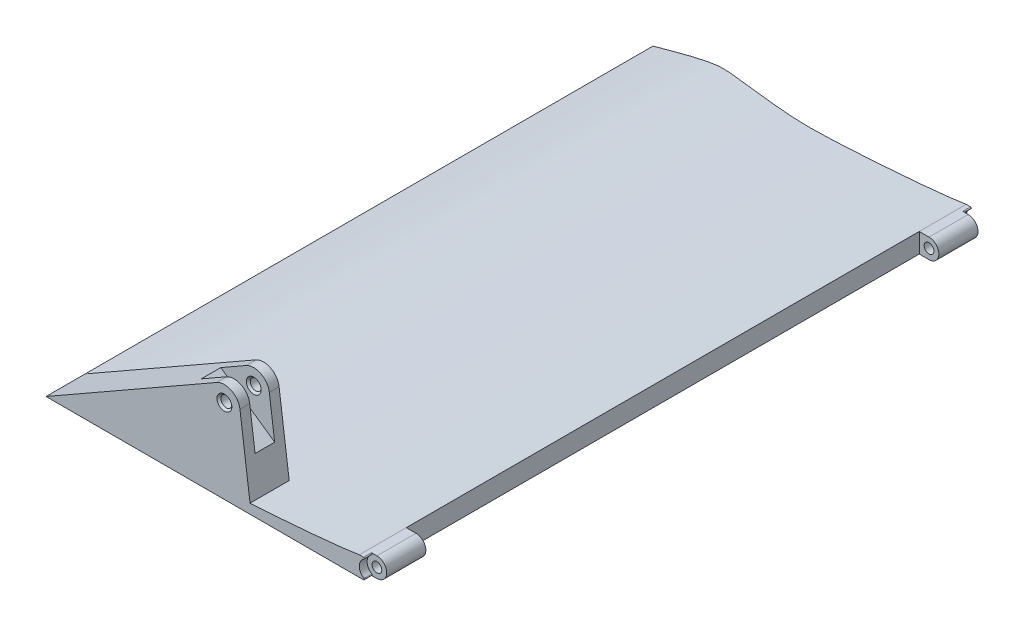
ISO-10303-21;
HEADER;
FILE_DESCRIPTION(('STEP AP214'),'2;1');
FILE_NAME('part.step','',(''),(''),'','','');
FILE_SCHEMA(('AUTOMOTIVE_DESIGN { 1 0 10303 214 1 1 1 1 }'));
ENDSEC;
DATA;
#1=APPLICATION_CONTEXT('core data for automotive mechanical design processes');
#2=APPLICATION_PROTOCOL_DEFINITION('international standard','automotive_design',2000,#1);
#3=PRODUCT_CONTEXT('',#1,'mechanical');
#4=PRODUCT('Part','Part','',(#3));
#5=PRODUCT_RELATED_PRODUCT_CATEGORY('part','',(#4));
#6=PRODUCT_DEFINITION_FORMATION('','',#4);
#7=PRODUCT_DEFINITION_CONTEXT('part definition',#1,'design');
#8=PRODUCT_DEFINITION('design','',#6,#7);
#9=PRODUCT_DEFINITION_SHAPE('','',#8);
#10=(LENGTH_UNIT() NAMED_UNIT(*) SI_UNIT(.MILLI.,.METRE.));
#11=(NAMED_UNIT(*) PLANE_ANGLE_UNIT() SI_UNIT($,.RADIAN.));
#12=(NAMED_UNIT(*) SI_UNIT($,.STERADIAN.) SOLID_ANGLE_UNIT());
#13=UNCERTAINTY_MEASURE_WITH_UNIT(LENGTH_MEASURE(1.E-05),#10,'distance_accuracy_value','');
#14=(GEOMETRIC_REPRESENTATION_CONTEXT(3) GLOBAL_UNCERTAINTY_ASSIGNED_CONTEXT((#13)) GLOBAL_UNIT_ASSIGNED_CONTEXT((#10,
#11,#12)) REPRESENTATION_CONTEXT('',''));
#15=CARTESIAN_POINT('',(0.,0.,0.));
#16=DIRECTION('',(0.,0.,1.));
#17=DIRECTION('',(1.,0.,0.));
#18=AXIS2_PLACEMENT_3D('',#15,#16,#17);
#19=CARTESIAN_POINT('',(5.55823766597802,21.4177270736507,67.5));
#20=DIRECTION('',(0.,0.,1.));
#21=DIRECTION('',(1.,0.,0.));
#22=AXIS2_PLACEMENT_3D('',#19,#20,#21);
#23=CYLINDRICAL_SURFACE('',#22,4.);
#24=CARTESIAN_POINT('',(5.55823766597802,21.4177270736507,70.));
#25=DIRECTION('',(0.,0.,-1.));
#26=DIRECTION('',(-1.,0.,0.));
#27=AXIS2_PLACEMENT_3D('',#24,#25,#26);
#28=CIRCLE('',#27,4.);
#29=CARTESIAN_POINT('',(9.52364594723854,21.9426434126139,70.));
#30=VERTEX_POINT('',#29);
#31=CARTESIAN_POINT('',(3.57419552363771,24.8909930838229,70.));
#32=VERTEX_POINT('',#31);
#33=EDGE_CURVE('E228',#30,#32,#28,.F.);
#34=ORIENTED_EDGE('',*,*,#33,.F.);
#35=DIRECTION('',(0.,0.,1.));
#36=VECTOR('',#35,1.);
#37=CARTESIAN_POINT('',(9.52364594723854,21.9426434126139,67.5));
#38=LINE('',#37,#36);
#39=CARTESIAN_POINT('',(9.52364594723854,21.9426434126139,67.5));
#40=VERTEX_POINT('',#39);
#41=EDGE_CURVE('E227',#40,#30,#38,.T.);
#42=ORIENTED_EDGE('',*,*,#41,.F.);
#43=CARTESIAN_POINT('',(5.55823766597802,21.4177270736507,67.5));
#44=DIRECTION('',(0.,0.,1.));
#45=DIRECTION('',(-1.,0.,0.));
#46=AXIS2_PLACEMENT_3D('',#43,#44,#45);
#47=CIRCLE('',#46,4.);
#48=CARTESIAN_POINT('',(3.57419552363771,24.8909930838229,67.5));
#49=VERTEX_POINT('',#48);
#50=EDGE_CURVE('E242',#40,#49,#47,.T.);
#51=ORIENTED_EDGE('',*,*,#50,.T.);
#52=DIRECTION('',(0.,0.,1.));
#53=VECTOR('',#52,1.);
#54=CARTESIAN_POINT('',(3.57419552363771,24.8909930838229,67.5));
#55=LINE('',#54,#53);
#56=EDGE_CURVE('E254',#49,#32,#55,.T.);
#57=ORIENTED_EDGE('',*,*,#56,.T.);
#58=EDGE_LOOP('',(#34,#42,#51,#57));
#59=FACE_BOUND('',#58,.T.);
#60=ADVANCED_FACE('F45',(#59),#23,.T.);
#61=CARTESIAN_POINT('',(5.55823766597802,21.4177270736507,67.5));
#62=DIRECTION('',(0.,0.,1.));
#63=DIRECTION('',(1.,0.,0.));
#64=AXIS2_PLACEMENT_3D('',#61,#62,#63);
#65=CYLINDRICAL_SURFACE('',#64,1.4);
#66=CARTESIAN_POINT('',(5.55823766597802,21.4177270736507,69.4999999999999));
#67=DIRECTION('',(0.,0.,-1.));
#68=DIRECTION('',(-1.,0.,0.));
#69=AXIS2_PLACEMENT_3D('',#66,#67,#68);
#70=CIRCLE('',#69,1.4);
#71=CARTESIAN_POINT('',(4.15823766597802,21.4177270736507,69.4999999999999));
#72=VERTEX_POINT('',#71);
#73=EDGE_CURVE('E285',#72,#72,#70,.F.);
#74=ORIENTED_EDGE('',*,*,#73,.T.);
#75=EDGE_LOOP('',(#74));
#76=FACE_BOUND('',#75,.T.);
#77=CARTESIAN_POINT('',(5.55823766597802,21.4177270736507,67.5));
#78=DIRECTION('',(0.,0.,1.));
#79=DIRECTION('',(1.,0.,0.));
#80=AXIS2_PLACEMENT_3D('',#77,#78,#79);
#81=CIRCLE('',#80,1.4);
#82=CARTESIAN_POINT('',(6.95823766597802,21.4177270736507,67.5));
#83=VERTEX_POINT('',#82);
#84=EDGE_CURVE('E236',#83,#83,#81,.T.);
#85=ORIENTED_EDGE('',*,*,#84,.F.);
#86=EDGE_LOOP('',(#85));
#87=FACE_BOUND('',#86,.T.);
#88=ADVANCED_FACE('F426',(#76,#87),#65,.F.);
#89=CARTESIAN_POINT('',(42.5,2.50000000000001,77.5));
#90=DIRECTION('',(0.,0.,-1.));
#91=DIRECTION('',(-1.,0.,0.));
#92=AXIS2_PLACEMENT_3D('',#89,#90,#91);
#93=CYLINDRICAL_SURFACE('',#92,2.50000000000001);
#94=DIRECTION('',(0.,0.,-1.));
#95=VECTOR('',#94,1.);
#96=CARTESIAN_POINT('',(42.5,0.,77.5));
#97=LINE('',#96,#95);
#98=CARTESIAN_POINT('',(42.5,0.,75.5));
#99=VERTEX_POINT('',#98);
#100=CARTESIAN_POINT('',(42.5,0.,65.5));
#101=VERTEX_POINT('',#100);
#102=EDGE_CURVE('E282',#99,#101,#97,.T.);
#103=ORIENTED_EDGE('',*,*,#102,.T.);
#104=CARTESIAN_POINT('',(42.5,2.50000000000001,65.5));
#105=DIRECTION('',(0.,0.,1.));
#106=DIRECTION('',(1.,0.,0.));
#107=AXIS2_PLACEMENT_3D('',#104,#105,#106);
#108=CIRCLE('',#107,2.50000000000001);
#109=CARTESIAN_POINT('',(42.5,5.00000000000002,65.5));
#110=VERTEX_POINT('',#109);
#111=EDGE_CURVE('E531',#101,#110,#108,.T.);
#112=ORIENTED_EDGE('',*,*,#111,.T.);
#113=DIRECTION('',(0.,0.,-1.));
#114=VECTOR('',#113,1.);
#115=CARTESIAN_POINT('',(42.5,5.00000000000002,77.5));
#116=LINE('',#115,#114);
#117=CARTESIAN_POINT('',(42.5,5.00000000000002,75.5));
#118=VERTEX_POINT('',#117);
#119=EDGE_CURVE('E480',#118,#110,#116,.T.);
#120=ORIENTED_EDGE('',*,*,#119,.F.);
#121=CARTESIAN_POINT('',(42.5,2.50000000000001,75.5));
#122=DIRECTION('',(0.,0.,1.));
#123=DIRECTION('',(1.,0.,0.));
#124=AXIS2_PLACEMENT_3D('',#121,#122,#123);
#125=CIRCLE('',#124,2.50000000000531);
#126=EDGE_CURVE('E356',#99,#118,#125,.T.);
#127=ORIENTED_EDGE('',*,*,#126,.F.);
#128=EDGE_LOOP('',(#103,#112,#120,#127));
#129=FACE_BOUND('',#128,.T.);
#130=ADVANCED_FACE('F398',(#129),#93,.T.);
#131=CARTESIAN_POINT('',(42.5,2.50000000000001,77.5));
#132=DIRECTION('',(0.,0.,-1.));
#133=DIRECTION('',(-1.,0.,0.));
#134=AXIS2_PLACEMENT_3D('',#131,#132,#133);
#135=CYLINDRICAL_SURFACE('',#134,1.25);
#136=CARTESIAN_POINT('',(42.5,2.50000000000001,65.5));
#137=DIRECTION('',(0.,0.,1.));
#138=DIRECTION('',(1.,0.,0.));
#139=AXIS2_PLACEMENT_3D('',#136,#137,#138);
#140=CIRCLE('',#139,1.25);
#141=CARTESIAN_POINT('',(43.75,2.50000000000001,65.5));
#142=VERTEX_POINT('',#141);
#143=EDGE_CURVE('E515',#142,#142,#140,.T.);
#144=ORIENTED_EDGE('',*,*,#143,.F.);
#145=EDGE_LOOP('',(#144));
#146=FACE_BOUND('',#145,.T.);
#147=CARTESIAN_POINT('',(42.5,2.50000000000001,75.5));
#148=DIRECTION('',(0.,0.,1.));
#149=DIRECTION('',(1.,0.,0.));
#150=AXIS2_PLACEMENT_3D('',#147,#148,#149);
#151=CIRCLE('',#150,1.25);
#152=CARTESIAN_POINT('',(43.75,2.50000000000001,75.5));
#153=VERTEX_POINT('',#152);
#154=EDGE_CURVE('E483',#153,#153,#151,.T.);
#155=ORIENTED_EDGE('',*,*,#154,.T.);
#156=EDGE_LOOP('',(#155));
#157=FACE_BOUND('',#156,.T.);
#158=ADVANCED_FACE('F597',(#146,#157),#135,.F.);
#159=CARTESIAN_POINT('',(40.,5.00000000000002,77.5));
#160=DIRECTION('',(0.,-1.,0.));
#161=DIRECTION('',(0.,0.,-1.));
#162=AXIS2_PLACEMENT_3D('',#159,#160,#161);
#163=PLANE('',#162);
#164=DIRECTION('',(-1.,0.,0.));
#165=VECTOR('',#164,1.);
#166=CARTESIAN_POINT('',(40.,5.00000000000002,77.5));
#167=LINE('',#166,#165);
#168=CARTESIAN_POINT('',(41.0857864376168,5.00000000000002,77.5));
#169=VERTEX_POINT('',#168);
#170=CARTESIAN_POINT('',(40.,5.00000000000002,77.5));
#171=VERTEX_POINT('',#170);
#172=EDGE_CURVE('E365',#169,#171,#167,.T.);
#173=ORIENTED_EDGE('',*,*,#172,.F.);
#174=DIRECTION('',(0.,0.,1.));
#175=VECTOR('',#174,1.);
#176=CARTESIAN_POINT('',(41.0857864376168,5.00000000000002,77.5));
#177=LINE('',#176,#175);
#178=CARTESIAN_POINT('',(41.0857864376168,5.00000000000002,75.5));
#179=VERTEX_POINT('',#178);
#180=EDGE_CURVE('E323',#169,#179,#177,.F.);
#181=ORIENTED_EDGE('',*,*,#180,.T.);
#182=DIRECTION('',(1.,0.,0.));
#183=VECTOR('',#182,1.);
#184=CARTESIAN_POINT('',(42.5,5.00000000000002,75.5));
#185=LINE('',#184,#183);
#186=EDGE_CURVE('E321',#179,#118,#185,.T.);
#187=ORIENTED_EDGE('',*,*,#186,.T.);
#188=ORIENTED_EDGE('',*,*,#119,.T.);
#189=DIRECTION('',(-1.,0.,0.));
#190=VECTOR('',#189,1.);
#191=CARTESIAN_POINT('',(42.5,5.00000000000002,65.5));
#192=LINE('',#191,#190);
#193=CARTESIAN_POINT('',(40.,5.00000000000002,65.5));
#194=VERTEX_POINT('',#193);
#195=EDGE_CURVE('E538',#110,#194,#192,.T.);
#196=ORIENTED_EDGE('',*,*,#195,.T.);
#197=DIRECTION('',(0.,0.,-1.));
#198=VECTOR('',#197,1.);
#199=CARTESIAN_POINT('',(40.,5.00000000000002,77.5));
#200=LINE('',#199,#198);
#201=EDGE_CURVE('E468',#171,#194,#200,.T.);
#202=ORIENTED_EDGE('',*,*,#201,.F.);
#203=EDGE_LOOP('',(#173,#181,#187,#188,#196,#202));
#204=FACE_BOUND('',#203,.T.);
#205=ADVANCED_FACE('F392',(#204),#163,.F.);
#206=CARTESIAN_POINT('',(42.5,5.00000000000002,-65.5));
#207=VERTEX_POINT('',#206);
#208=CARTESIAN_POINT('',(42.5,5.00000000000002,-75.5));
#209=VERTEX_POINT('',#208);
#210=EDGE_CURVE('E478',#207,#209,#116,.T.);
#211=ORIENTED_EDGE('',*,*,#210,.F.);
#212=CARTESIAN_POINT('',(42.5,2.50000000000001,-65.5));
#213=DIRECTION('',(0.,0.,-1.));
#214=DIRECTION('',(-1.,0.,0.));
#215=AXIS2_PLACEMENT_3D('',#212,#213,#214);
#216=CIRCLE('',#215,2.50000000000001);
#217=CARTESIAN_POINT('',(42.5,0.,-65.5));
#218=VERTEX_POINT('',#217);
#219=EDGE_CURVE('E545',#218,#207,#216,.F.);
#220=ORIENTED_EDGE('',*,*,#219,.F.);
#221=CARTESIAN_POINT('',(42.5,0.,-75.5));
#222=VERTEX_POINT('',#221);
#223=EDGE_CURVE('E481',#218,#222,#97,.T.);
#224=ORIENTED_EDGE('',*,*,#223,.T.);
#225=CARTESIAN_POINT('',(42.5,2.50000000000001,-75.5));
#226=DIRECTION('',(0.,0.,1.));
#227=DIRECTION('',(1.,0.,0.));
#228=AXIS2_PLACEMENT_3D('',#225,#226,#227);
#229=CIRCLE('',#228,2.50000000000531);
#230=EDGE_CURVE('E509',#222,#209,#229,.T.);
#231=ORIENTED_EDGE('',*,*,#230,.T.);
#232=EDGE_LOOP('',(#211,#220,#224,#231));
#233=FACE_BOUND('',#232,.T.);
#234=ADVANCED_FACE('F393',(#233),#93,.T.);
#235=CARTESIAN_POINT('',(42.5,2.50000000000001,-65.5));
#236=DIRECTION('',(0.,0.,-1.));
#237=DIRECTION('',(-1.,0.,0.));
#238=AXIS2_PLACEMENT_3D('',#235,#236,#237);
#239=CIRCLE('',#238,1.25);
#240=CARTESIAN_POINT('',(41.25,2.50000000000001,-65.5));
#241=VERTEX_POINT('',#240);
#242=EDGE_CURVE('E518',#241,#241,#239,.T.);
#243=ORIENTED_EDGE('',*,*,#242,.F.);
#244=EDGE_LOOP('',(#243));
#245=FACE_BOUND('',#244,.T.);
#246=CARTESIAN_POINT('',(42.5,2.50000000000001,-75.5));
#247=DIRECTION('',(0.,0.,-1.));
#248=DIRECTION('',(-1.,0.,0.));
#249=AXIS2_PLACEMENT_3D('',#246,#247,#248);
#250=CIRCLE('',#249,1.25);
#251=CARTESIAN_POINT('',(41.25,2.50000000000001,-75.5));
#252=VERTEX_POINT('',#251);
#253=EDGE_CURVE('E357',#252,#252,#250,.T.);
#254=ORIENTED_EDGE('',*,*,#253,.T.);
#255=EDGE_LOOP('',(#254));
#256=FACE_BOUND('',#255,.T.);
#257=ADVANCED_FACE('F396',(#245,#256),#135,.F.);
#258=CARTESIAN_POINT('',(42.5,2.50000000000001,77.5));
#259=DIRECTION('',(0.,0.,-1.));
#260=DIRECTION('',(-1.,0.,0.));
#261=AXIS2_PLACEMENT_3D('',#258,#259,#260);
#262=PLANE('',#261);
#263=CARTESIAN_POINT('',(5.55823766597802,21.4177270736507,77.5));
#264=DIRECTION('',(0.,0.,-1.));
#265=DIRECTION('',(-1.,0.,0.));
#266=AXIS2_PLACEMENT_3D('',#263,#264,#265);
#267=CIRCLE('',#266,1.90000000000007);
#268=CARTESIAN_POINT('',(3.65823766597795,21.4177270736507,77.5));
#269=VERTEX_POINT('',#268);
#270=EDGE_CURVE('E281',#269,#269,#267,.T.);
#271=ORIENTED_EDGE('',*,*,#270,.T.);
#272=EDGE_LOOP('',(#271));
#273=FACE_BOUND('',#272,.T.);
#274=DIRECTION('',(1.,0.,0.));
#275=VECTOR('',#274,1.);
#276=CARTESIAN_POINT('',(40.,0.,77.5));
#277=LINE('',#276,#275);
#278=CARTESIAN_POINT('',(-40.,0.,77.5));
#279=VERTEX_POINT('',#278);
#280=CARTESIAN_POINT('',(41.0857864376168,0.,77.5));
#281=VERTEX_POINT('',#280);
#282=EDGE_CURVE('E352',#279,#281,#277,.T.);
#283=ORIENTED_EDGE('',*,*,#282,.T.);
#284=CARTESIAN_POINT('',(41.0857864376168,0.200000000000015,77.5));
#285=DIRECTION('',(0.,0.,-1.));
#286=DIRECTION('',(-1.,0.,0.));
#287=AXIS2_PLACEMENT_3D('',#284,#285,#286);
#288=CIRCLE('',#287,0.2);
#289=CARTESIAN_POINT('',(41.1905429977931,0.370370370370051,77.5));
#290=VERTEX_POINT('',#289);
#291=EDGE_CURVE('E319',#281,#290,#288,.F.);
#292=ORIENTED_EDGE('',*,*,#291,.T.);
#293=CARTESIAN_POINT('',(42.5,2.50000000000001,77.5));
#294=DIRECTION('',(0.,0.,1.));
#295=DIRECTION('',(1.,0.,0.));
#296=AXIS2_PLACEMENT_3D('',#293,#294,#295);
#297=CIRCLE('',#296,2.50000000000531);
#298=CARTESIAN_POINT('',(41.1905429977931,4.62962962962998,77.5));
#299=VERTEX_POINT('',#298);
#300=EDGE_CURVE('E350',#299,#290,#297,.T.);
#301=ORIENTED_EDGE('',*,*,#300,.F.);
#302=CARTESIAN_POINT('',(41.0857864376168,4.80000000000001,77.5));
#303=DIRECTION('',(0.,0.,-1.));
#304=DIRECTION('',(-1.,0.,0.));
#305=AXIS2_PLACEMENT_3D('',#302,#303,#304);
#306=CIRCLE('',#305,0.2);
#307=EDGE_CURVE('E317',#299,#169,#306,.F.);
#308=ORIENTED_EDGE('',*,*,#307,.T.);
#309=ORIENTED_EDGE('',*,*,#172,.T.);
#310=CARTESIAN_POINT('',(40.,5.00000000000002,77.5));
#311=CARTESIAN_POINT('',(33.4353685402655,3.87714761184845,77.5));
#312=CARTESIAN_POINT('',(8.79850073152249,1.98707372176733,77.5));
#313=CARTESIAN_POINT('',(-7.99591502217043,1.98173807115732,77.5));
#314=CARTESIAN_POINT('',(-20.7615702642566,4.49494492136742,77.5));
#315=CARTESIAN_POINT('',(-25.691582850293,3.96049141514272,77.5));
#316=CARTESIAN_POINT('',(-40.,0.,77.5));
#317=B_SPLINE_CURVE_WITH_KNOTS('',3,(#310,#311,#312,#313,#314,#315,#316),.UNSPECIFIED.,.F.,.F.,
(4,1,1,1,4),(0.,0.363185467999759,0.443702087394893,0.765003515445068,1.),.UNSPECIFIED.);
#318=CARTESIAN_POINT('',(12.1022744980429,2.46274871196199,77.5));
#319=VERTEX_POINT('',#318);
#320=EDGE_CURVE('E368',#171,#319,#317,.T.);
#321=ORIENTED_EDGE('',*,*,#320,.T.);
#322=DIRECTION('',(-0.131229084740795,0.991352070315129,0.));
#323=VECTOR('',#322,1.);
#324=CARTESIAN_POINT('',(9.52364594723854,21.9426434126139,77.5));
#325=LINE('',#324,#323);
#326=CARTESIAN_POINT('',(9.52364594723854,21.9426434126139,77.5));
#327=VERTEX_POINT('',#326);
#328=EDGE_CURVE('E239',#319,#327,#325,.T.);
#329=ORIENTED_EDGE('',*,*,#328,.T.);
#330=CARTESIAN_POINT('',(5.55823766597802,21.4177270736507,77.5));
#331=DIRECTION('',(0.,0.,1.));
#332=DIRECTION('',(-1.,0.,0.));
#333=AXIS2_PLACEMENT_3D('',#330,#331,#332);
#334=CIRCLE('',#333,4.);
#335=CARTESIAN_POINT('',(3.57419552363771,24.8909930838229,77.5));
#336=VERTEX_POINT('',#335);
#337=EDGE_CURVE('E249',#327,#336,#334,.T.);
#338=ORIENTED_EDGE('',*,*,#337,.T.);
#339=DIRECTION('',(-0.868316502543055,-0.496010535585078,0.));
#340=VECTOR('',#339,1.);
#341=CARTESIAN_POINT('',(-40.,0.,77.5));
#342=LINE('',#341,#340);
#343=EDGE_CURVE('E243',#336,#279,#342,.T.);
#344=ORIENTED_EDGE('',*,*,#343,.T.);
#345=EDGE_LOOP('',(#283,#292,#301,#308,#309,#321,#329,#338,#344));
#346=FACE_BOUND('',#345,.T.);
#347=ADVANCED_FACE('F349',(#273,#346),#262,.F.);
#348=CARTESIAN_POINT('',(42.5,2.50000000000001,-77.5));
#349=DIRECTION('',(0.,0.,-1.));
#350=DIRECTION('',(-1.,0.,0.));
#351=AXIS2_PLACEMENT_3D('',#348,#349,#350);
#352=PLANE('',#351);
#353=CARTESIAN_POINT('',(42.5,2.50000000000001,-77.5));
#354=DIRECTION('',(0.,0.,1.));
#355=DIRECTION('',(1.,0.,0.));
#356=AXIS2_PLACEMENT_3D('',#353,#354,#355);
#357=CIRCLE('',#356,2.50000000000531);
#358=CARTESIAN_POINT('',(41.1905429977931,4.62962962962998,-77.5));
#359=VERTEX_POINT('',#358);
#360=CARTESIAN_POINT('',(41.1905429977931,0.370370370370051,-77.5));
#361=VERTEX_POINT('',#360);
#362=EDGE_CURVE('E512',#359,#361,#357,.T.);
#363=ORIENTED_EDGE('',*,*,#362,.T.);
#364=CARTESIAN_POINT('',(41.0857864376168,0.200000000000015,-77.5));
#365=DIRECTION('',(0.,0.,-1.));
#366=DIRECTION('',(-1.,0.,0.));
#367=AXIS2_PLACEMENT_3D('',#364,#365,#366);
#368=CIRCLE('',#367,0.2);
#369=CARTESIAN_POINT('',(41.0857864376168,0.,-77.5));
#370=VERTEX_POINT('',#369);
#371=EDGE_CURVE('E299',#361,#370,#368,.T.);
#372=ORIENTED_EDGE('',*,*,#371,.T.);
#373=DIRECTION('',(1.,0.,0.));
#374=VECTOR('',#373,1.);
#375=CARTESIAN_POINT('',(-40.,0.,-77.5));
#376=LINE('',#375,#374);
#377=CARTESIAN_POINT('',(-40.,0.,-77.5));
#378=VERTEX_POINT('',#377);
#379=EDGE_CURVE('E366',#378,#370,#376,.T.);
#380=ORIENTED_EDGE('',*,*,#379,.F.);
#381=CARTESIAN_POINT('',(40.,5.00000000000002,-77.5));
#382=CARTESIAN_POINT('',(33.4353685402655,3.87714761184845,-77.5));
#383=CARTESIAN_POINT('',(8.79850073152249,1.98707372176733,-77.5));
#384=CARTESIAN_POINT('',(-7.99591502217043,1.98173807115732,-77.5));
#385=CARTESIAN_POINT('',(-20.7615702642566,4.49494492136742,-77.5));
#386=CARTESIAN_POINT('',(-25.691582850293,3.96049141514272,-77.5));
#387=CARTESIAN_POINT('',(-40.,0.,-77.5));
#388=B_SPLINE_CURVE_WITH_KNOTS('',3,(#381,#382,#383,#384,#385,#386,#387),.UNSPECIFIED.,.F.,.F.,
(4,1,1,1,4),(0.,0.363185467999759,0.443702087394893,0.765003515445068,1.),.UNSPECIFIED.);
#389=CARTESIAN_POINT('',(40.,5.00000000000002,-77.5));
#390=VERTEX_POINT('',#389);
#391=EDGE_CURVE('E487',#390,#378,#388,.T.);
#392=ORIENTED_EDGE('',*,*,#391,.F.);
#393=DIRECTION('',(-1.,0.,0.));
#394=VECTOR('',#393,1.);
#395=CARTESIAN_POINT('',(40.,5.00000000000002,-77.5));
#396=LINE('',#395,#394);
#397=CARTESIAN_POINT('',(41.0857864376168,5.00000000000002,-77.5));
#398=VERTEX_POINT('',#397);
#399=EDGE_CURVE('E375',#398,#390,#396,.T.);
#400=ORIENTED_EDGE('',*,*,#399,.F.);
#401=CARTESIAN_POINT('',(41.0857864376168,4.80000000000001,-77.5));
#402=DIRECTION('',(0.,0.,-1.));
#403=DIRECTION('',(-1.,0.,0.));
#404=AXIS2_PLACEMENT_3D('',#401,#402,#403);
#405=CIRCLE('',#404,0.2);
#406=EDGE_CURVE('E297',#398,#359,#405,.T.);
#407=ORIENTED_EDGE('',*,*,#406,.T.);
#408=EDGE_LOOP('',(#363,#372,#380,#392,#400,#407));
#409=FACE_BOUND('',#408,.T.);
#410=ADVANCED_FACE('F390',(#409),#352,.T.);
#411=ORIENTED_EDGE('',*,*,#210,.T.);
#412=DIRECTION('',(-1.,0.,0.));
#413=VECTOR('',#412,1.);
#414=CARTESIAN_POINT('',(42.5,5.00000000000002,-75.5));
#415=LINE('',#414,#413);
#416=CARTESIAN_POINT('',(41.0857864376168,5.00000000000002,-75.5));
#417=VERTEX_POINT('',#416);
#418=EDGE_CURVE('E68',#209,#417,#415,.T.);
#419=ORIENTED_EDGE('',*,*,#418,.T.);
#420=DIRECTION('',(0.,0.,1.));
#421=VECTOR('',#420,1.);
#422=CARTESIAN_POINT('',(41.0857864376168,5.00000000000002,-77.5));
#423=LINE('',#422,#421);
#424=EDGE_CURVE('E309',#417,#398,#423,.F.);
#425=ORIENTED_EDGE('',*,*,#424,.T.);
#426=ORIENTED_EDGE('',*,*,#399,.T.);
#427=CARTESIAN_POINT('',(40.,5.00000000000002,-65.5));
#428=VERTEX_POINT('',#427);
#429=EDGE_CURVE('E465',#428,#390,#200,.T.);
#430=ORIENTED_EDGE('',*,*,#429,.F.);
#431=DIRECTION('',(-1.,0.,0.));
#432=VECTOR('',#431,1.);
#433=CARTESIAN_POINT('',(42.5,5.00000000000002,-65.5));
#434=LINE('',#433,#432);
#435=EDGE_CURVE('E535',#207,#428,#434,.T.);
#436=ORIENTED_EDGE('',*,*,#435,.F.);
#437=EDGE_LOOP('',(#411,#419,#425,#426,#430,#436));
#438=FACE_BOUND('',#437,.T.);
#439=ADVANCED_FACE('F385',(#438),#163,.F.);
#440=DIRECTION('',(0.,0.,-1.));
#441=VECTOR('',#440,1.);
#442=SURFACE_OF_LINEAR_EXTRUSION('',#317,#441);
#443=CARTESIAN_POINT('',(40.,5.00000000000002,67.5));
#444=CARTESIAN_POINT('',(33.4353685402655,3.87714761184845,67.5));
#445=CARTESIAN_POINT('',(8.79850073152249,1.98707372176733,67.5));
#446=CARTESIAN_POINT('',(-7.99591502217043,1.98173807115732,67.5));
#447=CARTESIAN_POINT('',(-20.7615702642566,4.49494492136742,67.5));
#448=CARTESIAN_POINT('',(-25.691582850293,3.96049141514272,67.5));
#449=CARTESIAN_POINT('',(-40.,0.,67.5));
#450=B_SPLINE_CURVE_WITH_KNOTS('',3,(#443,#444,#445,#446,#447,#448,#449),.UNSPECIFIED.,.F.,.F.,
(4,1,1,1,4),(0.,0.363185467999759,0.443702087394893,0.765003515445068,1.),.UNSPECIFIED.);
#451=CARTESIAN_POINT('',(-40.,0.,67.5));
#452=VERTEX_POINT('',#451);
#453=CARTESIAN_POINT('',(12.1022744980429,2.46274871196199,67.5));
#454=VERTEX_POINT('',#453);
#455=EDGE_CURVE('E257',#452,#454,#450,.F.);
#456=ORIENTED_EDGE('',*,*,#455,.T.);
#457=DIRECTION('',(0.,0.,-1.));
#458=VECTOR('',#457,1.);
#459=CARTESIAN_POINT('',(12.1022744979501,2.46274871266279,77.5));
#460=LINE('',#459,#458);
#461=EDGE_CURVE('E265',#454,#319,#460,.F.);
#462=ORIENTED_EDGE('',*,*,#461,.T.);
#463=ORIENTED_EDGE('',*,*,#320,.F.);
#464=ORIENTED_EDGE('',*,*,#201,.T.);
#465=DIRECTION('',(0.,0.,-1.));
#466=VECTOR('',#465,1.);
#467=CARTESIAN_POINT('',(40.,5.00000000000002,82.5710678118655));
#468=LINE('',#467,#466);
#469=EDGE_CURVE('E532',#194,#428,#468,.T.);
#470=ORIENTED_EDGE('',*,*,#469,.T.);
#471=ORIENTED_EDGE('',*,*,#429,.T.);
#472=ORIENTED_EDGE('',*,*,#391,.T.);
#473=DIRECTION('',(0.,0.,-1.));
#474=VECTOR('',#473,1.);
#475=CARTESIAN_POINT('',(-40.,0.,77.5));
#476=LINE('',#475,#474);
#477=EDGE_CURVE('E374',#452,#378,#476,.T.);
#478=ORIENTED_EDGE('',*,*,#477,.F.);
#479=EDGE_LOOP('',(#456,#462,#463,#464,#470,#471,#472,#478));
#480=FACE_BOUND('',#479,.T.);
#481=ADVANCED_FACE('F381',(#480),#442,.F.);
#482=CARTESIAN_POINT('',(-40.,0.,77.5));
#483=DIRECTION('',(0.,1.,0.));
#484=DIRECTION('',(-1.,0.,0.));
#485=AXIS2_PLACEMENT_3D('',#482,#483,#484);
#486=PLANE('',#485);
#487=ORIENTED_EDGE('',*,*,#379,.T.);
#488=DIRECTION('',(0.,0.,1.));
#489=VECTOR('',#488,1.);
#490=CARTESIAN_POINT('',(41.0857864376168,0.,-75.5));
#491=LINE('',#490,#489);
#492=CARTESIAN_POINT('',(41.0857864376168,0.,-75.5));
#493=VERTEX_POINT('',#492);
#494=EDGE_CURVE('E306',#370,#493,#491,.T.);
#495=ORIENTED_EDGE('',*,*,#494,.T.);
#496=DIRECTION('',(1.,0.,0.));
#497=VECTOR('',#496,1.);
#498=CARTESIAN_POINT('',(42.5,0.,-75.5));
#499=LINE('',#498,#497);
#500=EDGE_CURVE('E304',#493,#222,#499,.T.);
#501=ORIENTED_EDGE('',*,*,#500,.T.);
#502=ORIENTED_EDGE('',*,*,#223,.F.);
#503=DIRECTION('',(1.,0.,0.));
#504=VECTOR('',#503,1.);
#505=CARTESIAN_POINT('',(40.,0.,-65.5));
#506=LINE('',#505,#504);
#507=CARTESIAN_POINT('',(40.,0.,-65.5));
#508=VERTEX_POINT('',#507);
#509=EDGE_CURVE('E543',#508,#218,#506,.T.);
#510=ORIENTED_EDGE('',*,*,#509,.F.);
#511=DIRECTION('',(0.,0.,-1.));
#512=VECTOR('',#511,1.);
#513=CARTESIAN_POINT('',(40.,0.,82.5710678118655));
#514=LINE('',#513,#512);
#515=CARTESIAN_POINT('',(40.,0.,65.5));
#516=VERTEX_POINT('',#515);
#517=EDGE_CURVE('E528',#516,#508,#514,.T.);
#518=ORIENTED_EDGE('',*,*,#517,.F.);
#519=DIRECTION('',(1.,0.,0.));
#520=VECTOR('',#519,1.);
#521=CARTESIAN_POINT('',(40.,0.,65.5));
#522=LINE('',#521,#520);
#523=EDGE_CURVE('E522',#516,#101,#522,.T.);
#524=ORIENTED_EDGE('',*,*,#523,.T.);
#525=ORIENTED_EDGE('',*,*,#102,.F.);
#526=DIRECTION('',(-1.,0.,0.));
#527=VECTOR('',#526,1.);
#528=CARTESIAN_POINT('',(42.5,0.,75.5));
#529=LINE('',#528,#527);
#530=CARTESIAN_POINT('',(41.0857864376168,0.,75.5));
#531=VERTEX_POINT('',#530);
#532=EDGE_CURVE('E60',#99,#531,#529,.T.);
#533=ORIENTED_EDGE('',*,*,#532,.T.);
#534=DIRECTION('',(0.,0.,1.));
#535=VECTOR('',#534,1.);
#536=CARTESIAN_POINT('',(41.0857864376168,0.,77.5));
#537=LINE('',#536,#535);
#538=EDGE_CURVE('E301',#531,#281,#537,.T.);
#539=ORIENTED_EDGE('',*,*,#538,.T.);
#540=ORIENTED_EDGE('',*,*,#282,.F.);
#541=EDGE_CURVE('E462',#279,#452,#476,.T.);
#542=ORIENTED_EDGE('',*,*,#541,.T.);
#543=ORIENTED_EDGE('',*,*,#477,.T.);
#544=EDGE_LOOP('',(#487,#495,#501,#502,#510,#518,#524,#525,#533,#539,#540,#542,#543));
#545=FACE_BOUND('',#544,.T.);
#546=ADVANCED_FACE('F338',(#545),#486,.F.);
#547=CARTESIAN_POINT('',(42.5,2.50000000000001,75.5));
#548=DIRECTION('',(0.,0.,1.));
#549=DIRECTION('',(1.,0.,0.));
#550=AXIS2_PLACEMENT_3D('',#547,#548,#549);
#551=CYLINDRICAL_SURFACE('',#550,2.50000000000531);
#552=ORIENTED_EDGE('',*,*,#300,.T.);
#553=DIRECTION('',(0.,0.,1.));
#554=VECTOR('',#553,1.);
#555=CARTESIAN_POINT('',(41.1905429977931,0.37037037037005,75.5));
#556=LINE('',#555,#554);
#557=CARTESIAN_POINT('',(41.1905429977931,0.370370370370051,75.5));
#558=VERTEX_POINT('',#557);
#559=EDGE_CURVE('E314',#290,#558,#556,.F.);
#560=ORIENTED_EDGE('',*,*,#559,.T.);
#561=CARTESIAN_POINT('',(41.1905429977931,4.62962962962998,75.5));
#562=VERTEX_POINT('',#561);
#563=EDGE_CURVE('E332',#562,#558,#125,.T.);
#564=ORIENTED_EDGE('',*,*,#563,.F.);
#565=DIRECTION('',(0.,0.,1.));
#566=VECTOR('',#565,1.);
#567=CARTESIAN_POINT('',(41.1905429977931,4.62962962962998,75.5));
#568=LINE('',#567,#566);
#569=EDGE_CURVE('E312',#562,#299,#568,.T.);
#570=ORIENTED_EDGE('',*,*,#569,.T.);
#571=EDGE_LOOP('',(#552,#560,#564,#570));
#572=FACE_BOUND('',#571,.T.);
#573=ADVANCED_FACE('F354',(#572),#551,.F.);
#574=CARTESIAN_POINT('',(42.5,2.50000000000001,75.5));
#575=DIRECTION('',(0.,0.,1.));
#576=DIRECTION('',(1.,0.,0.));
#577=AXIS2_PLACEMENT_3D('',#574,#575,#576);
#578=PLANE('',#577);
#579=ORIENTED_EDGE('',*,*,#154,.F.);
#580=EDGE_LOOP('',(#579));
#581=FACE_BOUND('',#580,.T.);
#582=ORIENTED_EDGE('',*,*,#126,.T.);
#583=ORIENTED_EDGE('',*,*,#186,.F.);
#584=CARTESIAN_POINT('',(41.0857864376168,4.80000000000001,75.5));
#585=DIRECTION('',(0.,0.,1.));
#586=DIRECTION('',(1.,0.,0.));
#587=AXIS2_PLACEMENT_3D('',#584,#585,#586);
#588=CIRCLE('',#587,0.2);
#589=EDGE_CURVE('E12',#179,#562,#588,.F.);
#590=ORIENTED_EDGE('',*,*,#589,.T.);
#591=ORIENTED_EDGE('',*,*,#563,.T.);
#592=CARTESIAN_POINT('',(41.0857864376168,0.200000000000015,75.5));
#593=DIRECTION('',(0.,0.,1.));
#594=DIRECTION('',(1.,0.,0.));
#595=AXIS2_PLACEMENT_3D('',#592,#593,#594);
#596=CIRCLE('',#595,0.2);
#597=EDGE_CURVE('E53',#558,#531,#596,.F.);
#598=ORIENTED_EDGE('',*,*,#597,.T.);
#599=ORIENTED_EDGE('',*,*,#532,.F.);
#600=EDGE_LOOP('',(#582,#583,#590,#591,#598,#599));
#601=FACE_BOUND('',#600,.T.);
#602=ADVANCED_FACE('F330',(#581,#601),#578,.T.);
#603=CARTESIAN_POINT('',(42.5,2.50000000000001,-75.5));
#604=DIRECTION('',(0.,0.,-1.));
#605=DIRECTION('',(-1.,0.,0.));
#606=AXIS2_PLACEMENT_3D('',#603,#604,#605);
#607=CYLINDRICAL_SURFACE('',#606,2.50000000000531);
#608=CARTESIAN_POINT('',(41.1905429977931,4.62962962962998,-75.5));
#609=VERTEX_POINT('',#608);
#610=CARTESIAN_POINT('',(41.1905429977931,0.370370370370051,-75.5));
#611=VERTEX_POINT('',#610);
#612=EDGE_CURVE('E361',#609,#611,#229,.T.);
#613=ORIENTED_EDGE('',*,*,#612,.T.);
#614=DIRECTION('',(0.,0.,-1.));
#615=VECTOR('',#614,1.);
#616=CARTESIAN_POINT('',(41.1905429977931,0.37037037037005,-75.5));
#617=LINE('',#616,#615);
#618=EDGE_CURVE('E294',#611,#361,#617,.T.);
#619=ORIENTED_EDGE('',*,*,#618,.T.);
#620=ORIENTED_EDGE('',*,*,#362,.F.);
#621=DIRECTION('',(0.,0.,-1.));
#622=VECTOR('',#621,1.);
#623=CARTESIAN_POINT('',(41.1905429977931,4.62962962962998,-75.5));
#624=LINE('',#623,#622);
#625=EDGE_CURVE('E291',#359,#609,#624,.F.);
#626=ORIENTED_EDGE('',*,*,#625,.T.);
#627=EDGE_LOOP('',(#613,#619,#620,#626));
#628=FACE_BOUND('',#627,.T.);
#629=ADVANCED_FACE('F505',(#628),#607,.F.);
#630=CARTESIAN_POINT('',(42.5,2.50000000000001,-75.5));
#631=DIRECTION('',(0.,0.,-1.));
#632=DIRECTION('',(1.,0.,0.));
#633=AXIS2_PLACEMENT_3D('',#630,#631,#632);
#634=PLANE('',#633);
#635=ORIENTED_EDGE('',*,*,#253,.F.);
#636=EDGE_LOOP('',(#635));
#637=FACE_BOUND('',#636,.T.);
#638=ORIENTED_EDGE('',*,*,#612,.F.);
#639=CARTESIAN_POINT('',(41.0857864376168,4.80000000000001,-75.5));
#640=DIRECTION('',(0.,0.,-1.));
#641=DIRECTION('',(-1.,0.,0.));
#642=AXIS2_PLACEMENT_3D('',#639,#640,#641);
#643=CIRCLE('',#642,0.2);
#644=EDGE_CURVE('E328',#609,#417,#643,.F.);
#645=ORIENTED_EDGE('',*,*,#644,.T.);
#646=ORIENTED_EDGE('',*,*,#418,.F.);
#647=ORIENTED_EDGE('',*,*,#230,.F.);
#648=ORIENTED_EDGE('',*,*,#500,.F.);
#649=CARTESIAN_POINT('',(41.0857864376168,0.200000000000015,-75.5));
#650=DIRECTION('',(0.,0.,-1.));
#651=DIRECTION('',(-1.,0.,0.));
#652=AXIS2_PLACEMENT_3D('',#649,#650,#651);
#653=CIRCLE('',#652,0.2);
#654=EDGE_CURVE('E326',#493,#611,#653,.F.);
#655=ORIENTED_EDGE('',*,*,#654,.T.);
#656=EDGE_LOOP('',(#638,#645,#646,#647,#648,#655));
#657=FACE_BOUND('',#656,.T.);
#658=ADVANCED_FACE('F503',(#637,#657),#634,.T.);
#659=CARTESIAN_POINT('',(40.,5.00000000000002,82.5710678118655));
#660=DIRECTION('',(1.,0.,0.));
#661=DIRECTION('',(0.,0.,-1.));
#662=AXIS2_PLACEMENT_3D('',#659,#660,#661);
#663=PLANE('',#662);
#664=DIRECTION('',(0.,-1.,0.));
#665=VECTOR('',#664,1.);
#666=CARTESIAN_POINT('',(40.,5.00000000000002,65.5));
#667=LINE('',#666,#665);
#668=EDGE_CURVE('E525',#194,#516,#667,.T.);
#669=ORIENTED_EDGE('',*,*,#668,.T.);
#670=ORIENTED_EDGE('',*,*,#517,.T.);
#671=DIRECTION('',(0.,-1.,0.));
#672=VECTOR('',#671,1.);
#673=CARTESIAN_POINT('',(40.,5.00000000000002,-65.5));
#674=LINE('',#673,#672);
#675=EDGE_CURVE('E546',#428,#508,#674,.T.);
#676=ORIENTED_EDGE('',*,*,#675,.F.);
#677=ORIENTED_EDGE('',*,*,#469,.F.);
#678=EDGE_LOOP('',(#669,#670,#676,#677));
#679=FACE_BOUND('',#678,.T.);
#680=ADVANCED_FACE('F561',(#679),#663,.T.);
#681=CARTESIAN_POINT('',(42.5,2.50000000000001,65.5));
#682=DIRECTION('',(0.,0.,1.));
#683=DIRECTION('',(1.,0.,0.));
#684=AXIS2_PLACEMENT_3D('',#681,#682,#683);
#685=PLANE('',#684);
#686=ORIENTED_EDGE('',*,*,#143,.T.);
#687=EDGE_LOOP('',(#686));
#688=FACE_BOUND('',#687,.T.);
#689=ORIENTED_EDGE('',*,*,#111,.F.);
#690=ORIENTED_EDGE('',*,*,#523,.F.);
#691=ORIENTED_EDGE('',*,*,#668,.F.);
#692=ORIENTED_EDGE('',*,*,#195,.F.);
#693=EDGE_LOOP('',(#689,#690,#691,#692));
#694=FACE_BOUND('',#693,.T.);
#695=ADVANCED_FACE('F574',(#688,#694),#685,.F.);
#696=CARTESIAN_POINT('',(42.5,2.50000000000001,-65.5));
#697=DIRECTION('',(0.,0.,-1.));
#698=DIRECTION('',(1.,0.,0.));
#699=AXIS2_PLACEMENT_3D('',#696,#697,#698);
#700=PLANE('',#699);
#701=ORIENTED_EDGE('',*,*,#242,.T.);
#702=EDGE_LOOP('',(#701));
#703=FACE_BOUND('',#702,.T.);
#704=ORIENTED_EDGE('',*,*,#435,.T.);
#705=ORIENTED_EDGE('',*,*,#675,.T.);
#706=ORIENTED_EDGE('',*,*,#509,.T.);
#707=ORIENTED_EDGE('',*,*,#219,.T.);
#708=EDGE_LOOP('',(#704,#705,#706,#707));
#709=FACE_BOUND('',#708,.T.);
#710=ADVANCED_FACE('F565',(#703,#709),#700,.F.);
#711=CARTESIAN_POINT('',(9.52364594723854,21.9426434126139,67.5));
#712=DIRECTION('',(0.991352070315129,0.131229084740795,0.));
#713=DIRECTION('',(-0.131229084740795,0.991352070315129,0.));
#714=AXIS2_PLACEMENT_3D('',#711,#712,#713);
#715=PLANE('',#714);
#716=DIRECTION('',(-0.131229084740795,0.99135207031513,0.));
#717=VECTOR('',#716,1.);
#718=CARTESIAN_POINT('',(9.52364594723854,21.9426434126139,70.));
#719=LINE('',#718,#717);
#720=CARTESIAN_POINT('',(10.8942445826759,11.5886445449415,70.));
#721=VERTEX_POINT('',#720);
#722=EDGE_CURVE('E214',#721,#30,#719,.T.);
#723=ORIENTED_EDGE('',*,*,#722,.F.);
#724=DIRECTION('',(0.,0.,1.));
#725=VECTOR('',#724,1.);
#726=CARTESIAN_POINT('',(10.8942445826759,11.5886445449415,47.9873958002885));
#727=LINE('',#726,#725);
#728=CARTESIAN_POINT('',(10.8942445826759,11.5886445449415,75.));
#729=VERTEX_POINT('',#728);
#730=EDGE_CURVE('E204',#721,#729,#727,.T.);
#731=ORIENTED_EDGE('',*,*,#730,.T.);
#732=DIRECTION('',(-0.131229084740795,0.991352070315129,0.));
#733=VECTOR('',#732,1.);
#734=CARTESIAN_POINT('',(9.52364594723854,21.9426434126139,75.));
#735=LINE('',#734,#733);
#736=CARTESIAN_POINT('',(9.52364594723854,21.9426434126139,75.));
#737=VERTEX_POINT('',#736);
#738=EDGE_CURVE('E456',#729,#737,#735,.T.);
#739=ORIENTED_EDGE('',*,*,#738,.T.);
#740=EDGE_CURVE('E260',#737,#327,#38,.T.);
#741=ORIENTED_EDGE('',*,*,#740,.T.);
#742=ORIENTED_EDGE('',*,*,#328,.F.);
#743=ORIENTED_EDGE('',*,*,#461,.F.);
#744=DIRECTION('',(-0.131229084740795,0.991352070315129,0.));
#745=VECTOR('',#744,1.);
#746=CARTESIAN_POINT('',(9.52364594723854,21.9426434126139,67.5));
#747=LINE('',#746,#745);
#748=EDGE_CURVE('E240',#454,#40,#747,.T.);
#749=ORIENTED_EDGE('',*,*,#748,.T.);
#750=ORIENTED_EDGE('',*,*,#41,.T.);
#751=EDGE_LOOP('',(#723,#731,#739,#741,#742,#743,#749,#750));
#752=FACE_BOUND('',#751,.T.);
#753=ADVANCED_FACE('F225',(#752),#715,.T.);
#754=CARTESIAN_POINT('',(5.55823766597802,21.4177270736507,67.5));
#755=DIRECTION('',(0.,0.,-1.));
#756=DIRECTION('',(-1.,0.,0.));
#757=AXIS2_PLACEMENT_3D('',#754,#755,#756);
#758=PLANE('',#757);
#759=ORIENTED_EDGE('',*,*,#84,.T.);
#760=EDGE_LOOP('',(#759));
#761=FACE_BOUND('',#760,.T.);
#762=ORIENTED_EDGE('',*,*,#455,.F.);
#763=DIRECTION('',(-0.868316502543055,-0.496010535585078,0.));
#764=VECTOR('',#763,1.);
#765=CARTESIAN_POINT('',(-40.,0.,67.5));
#766=LINE('',#765,#764);
#767=EDGE_CURVE('E246',#49,#452,#766,.T.);
#768=ORIENTED_EDGE('',*,*,#767,.F.);
#769=ORIENTED_EDGE('',*,*,#50,.F.);
#770=ORIENTED_EDGE('',*,*,#748,.F.);
#771=EDGE_LOOP('',(#762,#768,#769,#770));
#772=FACE_BOUND('',#771,.T.);
#773=ADVANCED_FACE('F449',(#761,#772),#758,.T.);
#774=CARTESIAN_POINT('',(-40.,0.,67.5));
#775=DIRECTION('',(-0.496010535585078,0.868316502543055,0.));
#776=DIRECTION('',(-0.868316502543055,-0.496010535585079,0.));
#777=AXIS2_PLACEMENT_3D('',#774,#775,#776);
#778=PLANE('',#777);
#779=DIRECTION('',(-0.868316502543055,-0.496010535585079,0.));
#780=VECTOR('',#779,1.);
#781=CARTESIAN_POINT('',(-2.87158990233628,21.2089514871928,70.));
#782=LINE('',#781,#780);
#783=CARTESIAN_POINT('',(-2.87158990233628,21.2089514871928,70.));
#784=VERTEX_POINT('',#783);
#785=EDGE_CURVE('E220',#32,#784,#782,.T.);
#786=ORIENTED_EDGE('',*,*,#785,.F.);
#787=ORIENTED_EDGE('',*,*,#56,.F.);
#788=ORIENTED_EDGE('',*,*,#767,.T.);
#789=ORIENTED_EDGE('',*,*,#541,.F.);
#790=ORIENTED_EDGE('',*,*,#343,.F.);
#791=CARTESIAN_POINT('',(3.57419552363771,24.8909930838229,75.));
#792=VERTEX_POINT('',#791);
#793=EDGE_CURVE('E258',#792,#336,#55,.T.);
#794=ORIENTED_EDGE('',*,*,#793,.F.);
#795=DIRECTION('',(-0.868316502543055,-0.496010535585079,0.));
#796=VECTOR('',#795,1.);
#797=CARTESIAN_POINT('',(-2.87158990233628,21.2089514871928,75.));
#798=LINE('',#797,#796);
#799=CARTESIAN_POINT('',(-2.87158990233628,21.2089514871928,75.));
#800=VERTEX_POINT('',#799);
#801=EDGE_CURVE('E460',#792,#800,#798,.T.);
#802=ORIENTED_EDGE('',*,*,#801,.T.);
#803=DIRECTION('',(0.,0.,1.));
#804=VECTOR('',#803,1.);
#805=CARTESIAN_POINT('',(-2.87158990233628,21.2089514871928,47.9873958002885));
#806=LINE('',#805,#804);
#807=EDGE_CURVE('E233',#784,#800,#806,.T.);
#808=ORIENTED_EDGE('',*,*,#807,.F.);
#809=EDGE_LOOP('',(#786,#787,#788,#789,#790,#794,#802,#808));
#810=FACE_BOUND('',#809,.T.);
#811=ADVANCED_FACE('F441',(#810),#778,.T.);
#812=CARTESIAN_POINT('',(5.55823766597802,21.4177270736507,75.));
#813=DIRECTION('',(0.,0.,1.));
#814=DIRECTION('',(1.,0.,0.));
#815=AXIS2_PLACEMENT_3D('',#812,#813,#814);
#816=CIRCLE('',#815,4.);
#817=EDGE_CURVE('E222',#737,#792,#816,.T.);
#818=ORIENTED_EDGE('',*,*,#817,.T.);
#819=ORIENTED_EDGE('',*,*,#793,.T.);
#820=ORIENTED_EDGE('',*,*,#337,.F.);
#821=ORIENTED_EDGE('',*,*,#740,.F.);
#822=EDGE_LOOP('',(#818,#819,#820,#821));
#823=FACE_BOUND('',#822,.T.);
#824=ADVANCED_FACE('F429',(#823),#23,.T.);
#825=CARTESIAN_POINT('',(5.55823766597802,21.4177270736507,76.9999999999999));
#826=DIRECTION('',(0.,0.,-1.));
#827=DIRECTION('',(-1.,0.,0.));
#828=AXIS2_PLACEMENT_3D('',#825,#826,#827);
#829=CIRCLE('',#828,1.4);
#830=CARTESIAN_POINT('',(4.15823766597802,21.4177270736507,76.9999999999999));
#831=VERTEX_POINT('',#830);
#832=EDGE_CURVE('E278',#831,#831,#829,.F.);
#833=ORIENTED_EDGE('',*,*,#832,.T.);
#834=EDGE_LOOP('',(#833));
#835=FACE_BOUND('',#834,.T.);
#836=CARTESIAN_POINT('',(5.55823766597802,21.4177270736507,75.));
#837=DIRECTION('',(0.,0.,1.));
#838=DIRECTION('',(1.,0.,0.));
#839=AXIS2_PLACEMENT_3D('',#836,#837,#838);
#840=CIRCLE('',#839,1.4);
#841=CARTESIAN_POINT('',(6.95823766597802,21.4177270736507,75.));
#842=VERTEX_POINT('',#841);
#843=EDGE_CURVE('E235',#842,#842,#840,.F.);
#844=ORIENTED_EDGE('',*,*,#843,.T.);
#845=EDGE_LOOP('',(#844));
#846=FACE_BOUND('',#845,.T.);
#847=ADVANCED_FACE('F437',(#835,#846),#65,.F.);
#848=CARTESIAN_POINT('',(5.55823766597802,21.4177270736507,70.));
#849=DIRECTION('',(0.,0.,-1.));
#850=DIRECTION('',(-1.,0.,0.));
#851=AXIS2_PLACEMENT_3D('',#848,#849,#850);
#852=PLANE('',#851);
#853=CARTESIAN_POINT('',(5.55823766597802,21.4177270736507,70.));
#854=DIRECTION('',(0.,0.,-1.));
#855=DIRECTION('',(-1.,0.,0.));
#856=AXIS2_PLACEMENT_3D('',#853,#854,#855);
#857=CIRCLE('',#856,1.90000000000007);
#858=CARTESIAN_POINT('',(3.65823766597795,21.4177270736507,70.));
#859=VERTEX_POINT('',#858);
#860=EDGE_CURVE('E288',#859,#859,#857,.T.);
#861=ORIENTED_EDGE('',*,*,#860,.T.);
#862=EDGE_LOOP('',(#861));
#863=FACE_BOUND('',#862,.T.);
#864=ORIENTED_EDGE('',*,*,#785,.T.);
#865=DIRECTION('',(0.819673024439004,-0.572831679472265,0.));
#866=VECTOR('',#865,1.);
#867=CARTESIAN_POINT('',(-2.87158990233628,21.2089514871928,70.));
#868=LINE('',#867,#866);
#869=EDGE_CURVE('E207',#784,#721,#868,.T.);
#870=ORIENTED_EDGE('',*,*,#869,.T.);
#871=ORIENTED_EDGE('',*,*,#722,.T.);
#872=ORIENTED_EDGE('',*,*,#33,.T.);
#873=EDGE_LOOP('',(#864,#870,#871,#872));
#874=FACE_BOUND('',#873,.T.);
#875=ADVANCED_FACE('F217',(#863,#874),#852,.F.);
#876=CARTESIAN_POINT('',(5.55823766597802,21.4177270736507,75.));
#877=DIRECTION('',(0.,0.,1.));
#878=DIRECTION('',(1.,0.,0.));
#879=AXIS2_PLACEMENT_3D('',#876,#877,#878);
#880=PLANE('',#879);
#881=ORIENTED_EDGE('',*,*,#801,.F.);
#882=ORIENTED_EDGE('',*,*,#817,.F.);
#883=ORIENTED_EDGE('',*,*,#738,.F.);
#884=DIRECTION('',(0.819673024439004,-0.572831679472265,0.));
#885=VECTOR('',#884,1.);
#886=CARTESIAN_POINT('',(-2.87158990233628,21.2089514871928,75.));
#887=LINE('',#886,#885);
#888=EDGE_CURVE('E210',#800,#729,#887,.T.);
#889=ORIENTED_EDGE('',*,*,#888,.F.);
#890=EDGE_LOOP('',(#881,#882,#883,#889));
#891=FACE_BOUND('',#890,.T.);
#892=ORIENTED_EDGE('',*,*,#843,.F.);
#893=EDGE_LOOP('',(#892));
#894=FACE_BOUND('',#893,.T.);
#895=ADVANCED_FACE('F682',(#891,#894),#880,.F.);
#896=CARTESIAN_POINT('',(-2.87158990233628,21.2089514871928,47.9873958002885));
#897=DIRECTION('',(-0.572831679472265,-0.819673024439004,0.));
#898=DIRECTION('',(0.819673024439004,-0.572831679472265,0.));
#899=AXIS2_PLACEMENT_3D('',#896,#897,#898);
#900=PLANE('',#899);
#901=ORIENTED_EDGE('',*,*,#807,.T.);
#902=ORIENTED_EDGE('',*,*,#888,.T.);
#903=ORIENTED_EDGE('',*,*,#730,.F.);
#904=ORIENTED_EDGE('',*,*,#869,.F.);
#905=EDGE_LOOP('',(#901,#902,#903,#904));
#906=FACE_BOUND('',#905,.T.);
#907=ADVANCED_FACE('F206',(#906),#900,.F.);
#908=CARTESIAN_POINT('',(5.55823766597802,21.4177270736507,76.9999999999999));
#909=DIRECTION('',(0.,0.,1.));
#910=DIRECTION('',(1.,0.,0.));
#911=AXIS2_PLACEMENT_3D('',#908,#909,#910);
#912=CONICAL_SURFACE('',#911,1.4,0.785398163397448);
#913=ORIENTED_EDGE('',*,*,#270,.F.);
#914=EDGE_LOOP('',(#913));
#915=FACE_BOUND('',#914,.T.);
#916=ORIENTED_EDGE('',*,*,#832,.F.);
#917=EDGE_LOOP('',(#916));
#918=FACE_BOUND('',#917,.T.);
#919=ADVANCED_FACE('F400',(#915,#918),#912,.F.);
#920=CARTESIAN_POINT('',(5.55823766597802,21.4177270736507,69.4999999999999));
#921=DIRECTION('',(0.,0.,1.));
#922=DIRECTION('',(1.,0.,0.));
#923=AXIS2_PLACEMENT_3D('',#920,#921,#922);
#924=CONICAL_SURFACE('',#923,1.4,0.785398163397449);
#925=ORIENTED_EDGE('',*,*,#860,.F.);
#926=EDGE_LOOP('',(#925));
#927=FACE_BOUND('',#926,.T.);
#928=ORIENTED_EDGE('',*,*,#73,.F.);
#929=EDGE_LOOP('',(#928));
#930=FACE_BOUND('',#929,.T.);
#931=ADVANCED_FACE('F406',(#927,#930),#924,.F.);
#932=CARTESIAN_POINT('',(41.0857864376168,0.200000000000015,-75.5));
#933=DIRECTION('',(0.,0.,-1.));
#934=DIRECTION('',(-1.,0.,0.));
#935=AXIS2_PLACEMENT_3D('',#932,#933,#934);
#936=CYLINDRICAL_SURFACE('',#935,0.2);
#937=ORIENTED_EDGE('',*,*,#654,.F.);
#938=ORIENTED_EDGE('',*,*,#494,.F.);
#939=ORIENTED_EDGE('',*,*,#371,.F.);
#940=ORIENTED_EDGE('',*,*,#618,.F.);
#941=EDGE_LOOP('',(#937,#938,#939,#940));
#942=FACE_BOUND('',#941,.T.);
#943=ADVANCED_FACE('F412',(#942),#936,.T.);
#944=CARTESIAN_POINT('',(41.0857864376168,4.80000000000001,-75.5));
#945=DIRECTION('',(0.,0.,-1.));
#946=DIRECTION('',(-1.,0.,0.));
#947=AXIS2_PLACEMENT_3D('',#944,#945,#946);
#948=CYLINDRICAL_SURFACE('',#947,0.2);
#949=ORIENTED_EDGE('',*,*,#406,.F.);
#950=ORIENTED_EDGE('',*,*,#424,.F.);
#951=ORIENTED_EDGE('',*,*,#644,.F.);
#952=ORIENTED_EDGE('',*,*,#625,.F.);
#953=EDGE_LOOP('',(#949,#950,#951,#952));
#954=FACE_BOUND('',#953,.T.);
#955=ADVANCED_FACE('F416',(#954),#948,.T.);
#956=CARTESIAN_POINT('',(41.0857864376168,0.200000000000015,75.5));
#957=DIRECTION('',(0.,0.,1.));
#958=DIRECTION('',(1.,0.,0.));
#959=AXIS2_PLACEMENT_3D('',#956,#957,#958);
#960=CYLINDRICAL_SURFACE('',#959,0.2);
#961=ORIENTED_EDGE('',*,*,#291,.F.);
#962=ORIENTED_EDGE('',*,*,#538,.F.);
#963=ORIENTED_EDGE('',*,*,#597,.F.);
#964=ORIENTED_EDGE('',*,*,#559,.F.);
#965=EDGE_LOOP('',(#961,#962,#963,#964));
#966=FACE_BOUND('',#965,.T.);
#967=ADVANCED_FACE('F345',(#966),#960,.T.);
#968=CARTESIAN_POINT('',(41.0857864376168,4.80000000000001,75.5));
#969=DIRECTION('',(0.,0.,1.));
#970=DIRECTION('',(1.,0.,0.));
#971=AXIS2_PLACEMENT_3D('',#968,#969,#970);
#972=CYLINDRICAL_SURFACE('',#971,0.2);
#973=ORIENTED_EDGE('',*,*,#307,.F.);
#974=ORIENTED_EDGE('',*,*,#569,.F.);
#975=ORIENTED_EDGE('',*,*,#589,.F.);
#976=ORIENTED_EDGE('',*,*,#180,.F.);
#977=EDGE_LOOP('',(#973,#974,#975,#976));
#978=FACE_BOUND('',#977,.T.);
#979=ADVANCED_FACE('F47',(#978),#972,.T.);
#980=CLOSED_SHELL('',(#60,#88,#130,#158,#205,#234,#257,#347,#410,#439,#481,#546,#573,#602,#629,
#658,#680,#695,#710,#753,#773,#811,#824,#847,#875,#895,#907,#919,#931,#943,#955,#967,#979));
#981=MANIFOLD_SOLID_BREP('B2',#980);
#982=ADVANCED_BREP_SHAPE_REPRESENTATION('',(#18,#981),#14);
#983=SHAPE_DEFINITION_REPRESENTATION(#9,#982);
ENDSEC;
END-ISO-10303-21;
